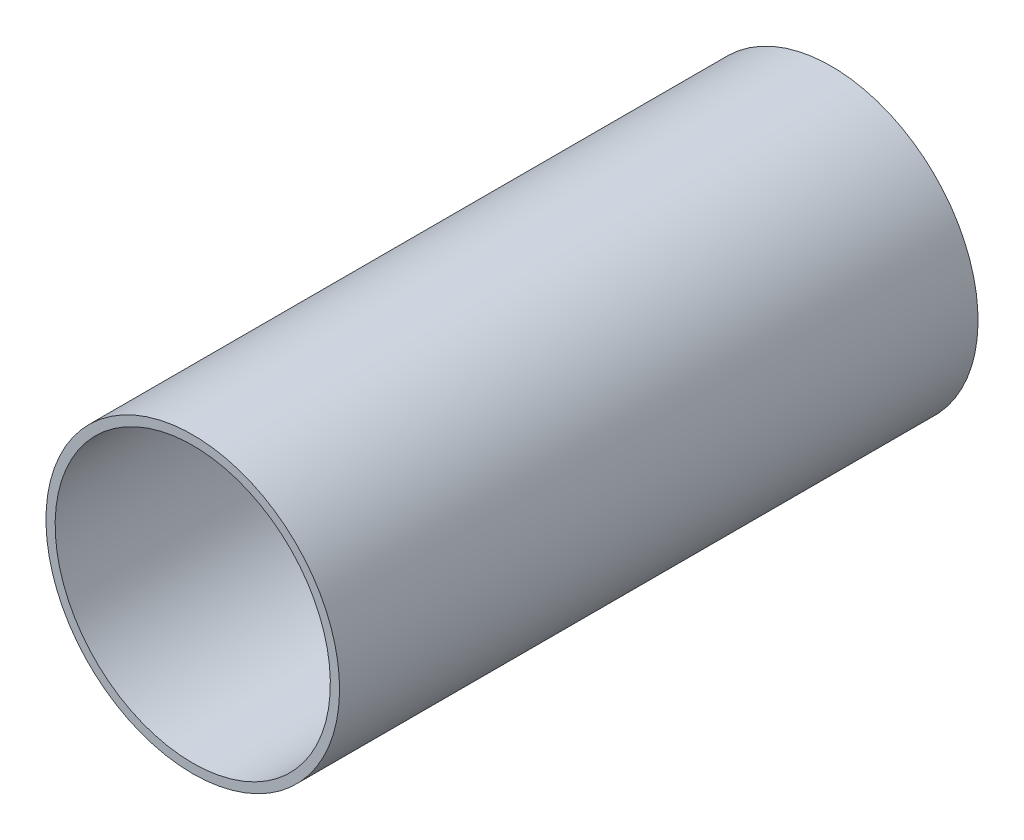
ISO-10303-21;
HEADER;
FILE_DESCRIPTION(('STEP AP214'),'2;1');
FILE_NAME('part.step','',(''),(''),'','','');
FILE_SCHEMA(('AUTOMOTIVE_DESIGN { 1 0 10303 214 1 1 1 1 }'));
ENDSEC;
DATA;
#1=APPLICATION_CONTEXT('core data for automotive mechanical design processes');
#2=APPLICATION_PROTOCOL_DEFINITION('international standard','automotive_design',2000,#1);
#3=PRODUCT_CONTEXT('',#1,'mechanical');
#4=PRODUCT('Part','Part','',(#3));
#5=PRODUCT_RELATED_PRODUCT_CATEGORY('part','',(#4));
#6=PRODUCT_DEFINITION_FORMATION('','',#4);
#7=PRODUCT_DEFINITION_CONTEXT('part definition',#1,'design');
#8=PRODUCT_DEFINITION('design','',#6,#7);
#9=PRODUCT_DEFINITION_SHAPE('','',#8);
#10=(LENGTH_UNIT() NAMED_UNIT(*) SI_UNIT(.MILLI.,.METRE.));
#11=(NAMED_UNIT(*) PLANE_ANGLE_UNIT() SI_UNIT($,.RADIAN.));
#12=(NAMED_UNIT(*) SI_UNIT($,.STERADIAN.) SOLID_ANGLE_UNIT());
#13=UNCERTAINTY_MEASURE_WITH_UNIT(LENGTH_MEASURE(1.E-05),#10,'distance_accuracy_value','');
#14=(GEOMETRIC_REPRESENTATION_CONTEXT(3) GLOBAL_UNCERTAINTY_ASSIGNED_CONTEXT((#13)) GLOBAL_UNIT_ASSIGNED_CONTEXT((#10,
#11,#12)) REPRESENTATION_CONTEXT('',''));
#15=CARTESIAN_POINT('',(0.,0.,0.));
#16=DIRECTION('',(0.,0.,1.));
#17=DIRECTION('',(1.,0.,0.));
#18=AXIS2_PLACEMENT_3D('',#15,#16,#17);
#19=CARTESIAN_POINT('',(139.7,-103.632,-0.045));
#20=DIRECTION('',(0.,0.,-1.));
#21=DIRECTION('',(0.,-1.,0.));
#22=AXIS2_PLACEMENT_3D('',#19,#20,#21);
#23=CYLINDRICAL_SURFACE('',#22,0.375);
#24=CARTESIAN_POINT('',(139.7,-103.632,-0.035));
#25=DIRECTION('',(0.,0.,-1.));
#26=DIRECTION('',(0.,-1.,0.));
#27=AXIS2_PLACEMENT_3D('',#24,#25,#26);
#28=CIRCLE('',#27,0.375);
#29=CARTESIAN_POINT('',(139.7,-104.007,-0.035));
#30=VERTEX_POINT('',#29);
#31=EDGE_CURVE('E65',#30,#30,#28,.T.);
#32=ORIENTED_EDGE('',*,*,#31,.T.);
#33=DIRECTION('',(0.,0.,1.));
#34=VECTOR('',#33,1.);
#35=CARTESIAN_POINT('',(139.7,-104.007,-0.045));
#36=LINE('',#35,#34);
#37=CARTESIAN_POINT('',(139.7,-104.007,1.705));
#38=VERTEX_POINT('',#37);
#39=EDGE_CURVE('E11',#30,#38,#36,.T.);
#40=ORIENTED_EDGE('',*,*,#39,.T.);
#41=CARTESIAN_POINT('',(139.7,-103.632,1.705));
#42=DIRECTION('',(0.,0.,-1.));
#43=DIRECTION('',(0.,-1.,0.));
#44=AXIS2_PLACEMENT_3D('',#41,#42,#43);
#45=CIRCLE('',#44,0.375);
#46=EDGE_CURVE('E20',#38,#38,#45,.T.);
#47=ORIENTED_EDGE('',*,*,#46,.F.);
#48=ORIENTED_EDGE('',*,*,#39,.F.);
#49=EDGE_LOOP('',(#32,#40,#47,#48));
#50=FACE_BOUND('',#49,.T.);
#51=ADVANCED_FACE('F17',(#50),#23,.F.);
#52=CARTESIAN_POINT('',(139.7,-104.032,1.705));
#53=DIRECTION('',(0.,0.,1.));
#54=DIRECTION('',(1.,0.,0.));
#55=AXIS2_PLACEMENT_3D('',#52,#53,#54);
#56=PLANE('',#55);
#57=ORIENTED_EDGE('',*,*,#46,.T.);
#58=EDGE_LOOP('',(#57));
#59=FACE_BOUND('',#58,.T.);
#60=CARTESIAN_POINT('',(139.7,-103.632,1.705));
#61=DIRECTION('',(0.,0.,1.));
#62=DIRECTION('',(0.,-1.,0.));
#63=AXIS2_PLACEMENT_3D('',#60,#61,#62);
#64=CIRCLE('',#63,0.4);
#65=CARTESIAN_POINT('',(139.7,-104.032,1.705));
#66=VERTEX_POINT('',#65);
#67=EDGE_CURVE('E57',#66,#66,#64,.T.);
#68=ORIENTED_EDGE('',*,*,#67,.T.);
#69=EDGE_LOOP('',(#68));
#70=FACE_BOUND('',#69,.T.);
#71=ADVANCED_FACE('F76',(#59,#70),#56,.T.);
#72=CARTESIAN_POINT('',(139.7,-104.032,-0.035));
#73=DIRECTION('',(0.,0.,1.));
#74=DIRECTION('',(1.,0.,0.));
#75=AXIS2_PLACEMENT_3D('',#72,#73,#74);
#76=PLANE('',#75);
#77=ORIENTED_EDGE('',*,*,#31,.F.);
#78=EDGE_LOOP('',(#77));
#79=FACE_BOUND('',#78,.T.);
#80=CARTESIAN_POINT('',(139.7,-103.632,-0.035));
#81=DIRECTION('',(0.,0.,1.));
#82=DIRECTION('',(0.,-1.,0.));
#83=AXIS2_PLACEMENT_3D('',#80,#81,#82);
#84=CIRCLE('',#83,0.4);
#85=CARTESIAN_POINT('',(139.7,-104.032,-0.035));
#86=VERTEX_POINT('',#85);
#87=EDGE_CURVE('E56',#86,#86,#84,.T.);
#88=ORIENTED_EDGE('',*,*,#87,.F.);
#89=EDGE_LOOP('',(#88));
#90=FACE_BOUND('',#89,.T.);
#91=ADVANCED_FACE('F84',(#79,#90),#76,.F.);
#92=CARTESIAN_POINT('',(139.7,-103.632,-0.035));
#93=DIRECTION('',(0.,0.,-1.));
#94=DIRECTION('',(0.,-1.,0.));
#95=AXIS2_PLACEMENT_3D('',#92,#93,#94);
#96=CYLINDRICAL_SURFACE('',#95,0.4);
#97=ORIENTED_EDGE('',*,*,#87,.T.);
#98=DIRECTION('',(0.,0.,1.));
#99=VECTOR('',#98,1.);
#100=CARTESIAN_POINT('',(139.7,-104.032,-0.035));
#101=LINE('',#100,#99);
#102=EDGE_CURVE('E53',#86,#66,#101,.T.);
#103=ORIENTED_EDGE('',*,*,#102,.T.);
#104=ORIENTED_EDGE('',*,*,#67,.F.);
#105=ORIENTED_EDGE('',*,*,#102,.F.);
#106=EDGE_LOOP('',(#97,#103,#104,#105));
#107=FACE_BOUND('',#106,.T.);
#108=ADVANCED_FACE('F54',(#107),#96,.T.);
#109=CLOSED_SHELL('',(#51,#71,#91,#108));
#110=MANIFOLD_SOLID_BREP('B1',#109);
#111=ADVANCED_BREP_SHAPE_REPRESENTATION('',(#18,#110),#14);
#112=SHAPE_DEFINITION_REPRESENTATION(#9,#111);
ENDSEC;
END-ISO-10303-21;
